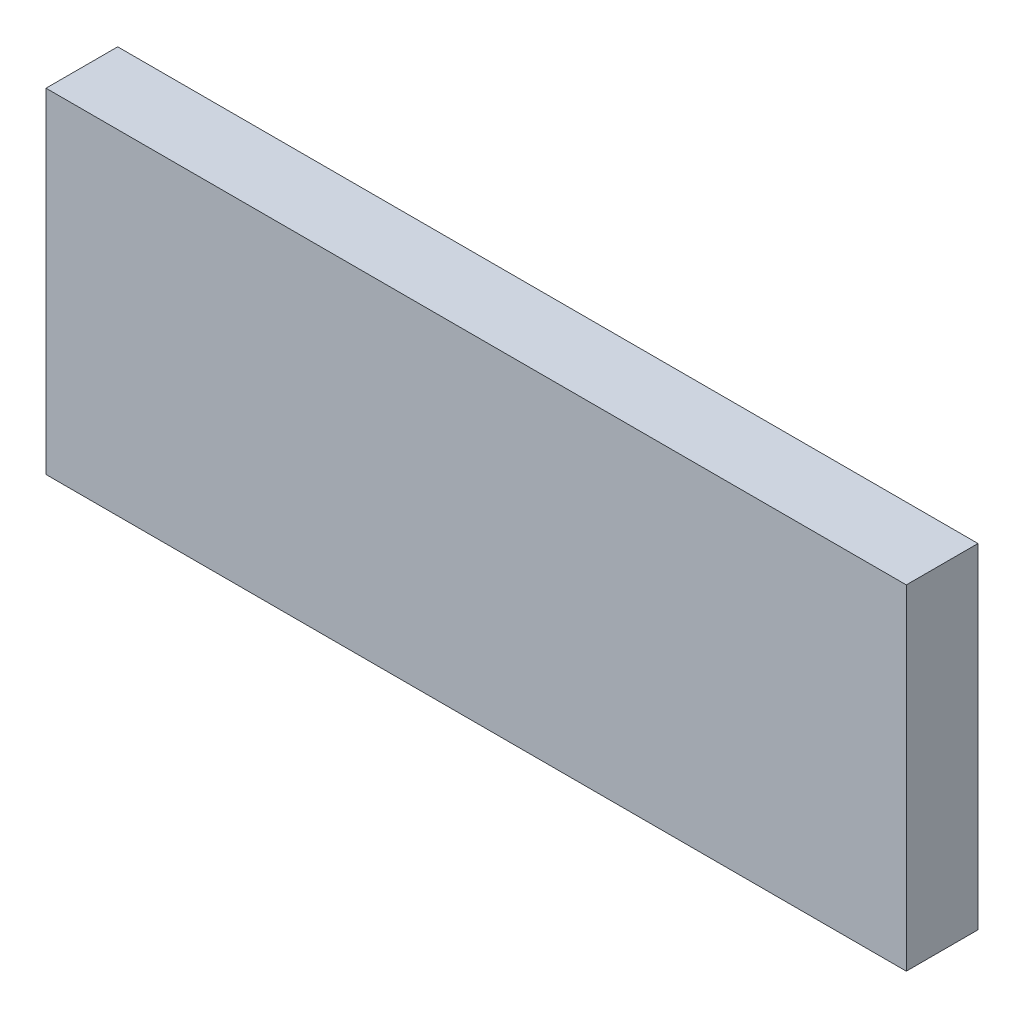
ISO-10303-21;
HEADER;
FILE_DESCRIPTION(('STEP AP214'),'2;1');
FILE_NAME('part.step','',(''),(''),'','','');
FILE_SCHEMA(('AUTOMOTIVE_DESIGN { 1 0 10303 214 1 1 1 1 }'));
ENDSEC;
DATA;
#1=APPLICATION_CONTEXT('core data for automotive mechanical design processes');
#2=APPLICATION_PROTOCOL_DEFINITION('international standard','automotive_design',2000,#1);
#3=PRODUCT_CONTEXT('',#1,'mechanical');
#4=PRODUCT('Part','Part','',(#3));
#5=PRODUCT_RELATED_PRODUCT_CATEGORY('part','',(#4));
#6=PRODUCT_DEFINITION_FORMATION('','',#4);
#7=PRODUCT_DEFINITION_CONTEXT('part definition',#1,'design');
#8=PRODUCT_DEFINITION('design','',#6,#7);
#9=PRODUCT_DEFINITION_SHAPE('','',#8);
#10=(LENGTH_UNIT() NAMED_UNIT(*) SI_UNIT(.MILLI.,.METRE.));
#11=(NAMED_UNIT(*) PLANE_ANGLE_UNIT() SI_UNIT($,.RADIAN.));
#12=(NAMED_UNIT(*) SI_UNIT($,.STERADIAN.) SOLID_ANGLE_UNIT());
#13=UNCERTAINTY_MEASURE_WITH_UNIT(LENGTH_MEASURE(1.E-05),#10,'distance_accuracy_value','');
#14=(GEOMETRIC_REPRESENTATION_CONTEXT(3) GLOBAL_UNCERTAINTY_ASSIGNED_CONTEXT((#13)) GLOBAL_UNIT_ASSIGNED_CONTEXT((#10,
#11,#12)) REPRESENTATION_CONTEXT('',''));
#15=CARTESIAN_POINT('',(0.,0.,0.));
#16=DIRECTION('',(0.,0.,1.));
#17=DIRECTION('',(1.,0.,0.));
#18=AXIS2_PLACEMENT_3D('',#15,#16,#17);
#19=CARTESIAN_POINT('',(0.,0.,0.));
#20=DIRECTION('',(0.,0.,-1.));
#21=DIRECTION('',(-1.,0.,0.));
#22=AXIS2_PLACEMENT_3D('',#19,#20,#21);
#23=PLANE('',#22);
#24=DIRECTION('',(0.,1.,0.));
#25=VECTOR('',#24,1.);
#26=CARTESIAN_POINT('',(-1.95,-1.15,0.));
#27=LINE('',#26,#25);
#28=CARTESIAN_POINT('',(-1.95,-1.85,0.));
#29=VERTEX_POINT('',#28);
#30=CARTESIAN_POINT('',(-1.95,-1.15,0.));
#31=VERTEX_POINT('',#30);
#32=EDGE_CURVE('E57',#29,#31,#27,.T.);
#33=ORIENTED_EDGE('',*,*,#32,.F.);
#34=DIRECTION('',(1.,0.,0.));
#35=VECTOR('',#34,1.);
#36=CARTESIAN_POINT('',(-1.95,-1.85,0.));
#37=LINE('',#36,#35);
#38=CARTESIAN_POINT('',(-3.75,-1.85,0.));
#39=VERTEX_POINT('',#38);
#40=EDGE_CURVE('E52',#39,#29,#37,.T.);
#41=ORIENTED_EDGE('',*,*,#40,.F.);
#42=DIRECTION('',(0.,1.,0.));
#43=VECTOR('',#42,1.);
#44=CARTESIAN_POINT('',(-3.75,0.,0.));
#45=LINE('',#44,#43);
#46=CARTESIAN_POINT('',(-3.75,-1.15,0.));
#47=VERTEX_POINT('',#46);
#48=EDGE_CURVE('E19',#39,#47,#45,.T.);
#49=ORIENTED_EDGE('',*,*,#48,.T.);
#50=DIRECTION('',(-1.,0.,0.));
#51=VECTOR('',#50,1.);
#52=CARTESIAN_POINT('',(-3.75,-1.15,0.));
#53=LINE('',#52,#51);
#54=EDGE_CURVE('E66',#31,#47,#53,.T.);
#55=ORIENTED_EDGE('',*,*,#54,.F.);
#56=EDGE_LOOP('',(#33,#41,#49,#55));
#57=FACE_BOUND('',#56,.T.);
#58=ADVANCED_FACE('F16',(#57),#23,.T.);
#59=CARTESIAN_POINT('',(-3.75,-1.15,0.15));
#60=DIRECTION('',(0.,1.,0.));
#61=DIRECTION('',(-1.,0.,0.));
#62=AXIS2_PLACEMENT_3D('',#59,#60,#61);
#63=PLANE('',#62);
#64=DIRECTION('',(-1.,0.,0.));
#65=VECTOR('',#64,1.);
#66=CARTESIAN_POINT('',(0.,-1.15,0.15));
#67=LINE('',#66,#65);
#68=CARTESIAN_POINT('',(-3.75,-1.15,0.15));
#69=VERTEX_POINT('',#68);
#70=CARTESIAN_POINT('',(-1.95,-1.15,0.15));
#71=VERTEX_POINT('',#70);
#72=EDGE_CURVE('E74',#69,#71,#67,.F.);
#73=ORIENTED_EDGE('',*,*,#72,.T.);
#74=DIRECTION('',(0.,0.,-1.));
#75=VECTOR('',#74,1.);
#76=CARTESIAN_POINT('',(-1.95,-1.15,0.15));
#77=LINE('',#76,#75);
#78=EDGE_CURVE('E62',#31,#71,#77,.F.);
#79=ORIENTED_EDGE('',*,*,#78,.F.);
#80=ORIENTED_EDGE('',*,*,#54,.T.);
#81=DIRECTION('',(0.,0.,1.));
#82=VECTOR('',#81,1.);
#83=CARTESIAN_POINT('',(-3.75,-1.15,0.15));
#84=LINE('',#83,#82);
#85=EDGE_CURVE('E80',#69,#47,#84,.F.);
#86=ORIENTED_EDGE('',*,*,#85,.F.);
#87=EDGE_LOOP('',(#73,#79,#80,#86));
#88=FACE_BOUND('',#87,.T.);
#89=ADVANCED_FACE('F73',(#88),#63,.T.);
#90=CARTESIAN_POINT('',(-1.95,-1.15,0.15));
#91=DIRECTION('',(1.,0.,0.));
#92=DIRECTION('',(0.,0.,-1.));
#93=AXIS2_PLACEMENT_3D('',#90,#91,#92);
#94=PLANE('',#93);
#95=DIRECTION('',(0.,1.,0.));
#96=VECTOR('',#95,1.);
#97=CARTESIAN_POINT('',(-1.95,0.,0.15));
#98=LINE('',#97,#96);
#99=CARTESIAN_POINT('',(-1.95,-1.85,0.15));
#100=VERTEX_POINT('',#99);
#101=EDGE_CURVE('E83',#71,#100,#98,.F.);
#102=ORIENTED_EDGE('',*,*,#101,.T.);
#103=DIRECTION('',(0.,0.,-1.));
#104=VECTOR('',#103,1.);
#105=CARTESIAN_POINT('',(-1.95,-1.85,0.15));
#106=LINE('',#105,#104);
#107=EDGE_CURVE('E64',#29,#100,#106,.F.);
#108=ORIENTED_EDGE('',*,*,#107,.F.);
#109=ORIENTED_EDGE('',*,*,#32,.T.);
#110=ORIENTED_EDGE('',*,*,#78,.T.);
#111=EDGE_LOOP('',(#102,#108,#109,#110));
#112=FACE_BOUND('',#111,.T.);
#113=ADVANCED_FACE('F60',(#112),#94,.T.);
#114=CARTESIAN_POINT('',(-1.95,-1.85,0.15));
#115=DIRECTION('',(0.,-1.,0.));
#116=DIRECTION('',(0.,0.,-1.));
#117=AXIS2_PLACEMENT_3D('',#114,#115,#116);
#118=PLANE('',#117);
#119=DIRECTION('',(-1.,0.,0.));
#120=VECTOR('',#119,1.);
#121=CARTESIAN_POINT('',(0.,-1.85,0.15));
#122=LINE('',#121,#120);
#123=CARTESIAN_POINT('',(-3.75,-1.85,0.15));
#124=VERTEX_POINT('',#123);
#125=EDGE_CURVE('E25',#100,#124,#122,.T.);
#126=ORIENTED_EDGE('',*,*,#125,.T.);
#127=DIRECTION('',(0.,0.,1.));
#128=VECTOR('',#127,1.);
#129=CARTESIAN_POINT('',(-3.75,-1.85,0.15));
#130=LINE('',#129,#128);
#131=EDGE_CURVE('E33',#39,#124,#130,.T.);
#132=ORIENTED_EDGE('',*,*,#131,.F.);
#133=ORIENTED_EDGE('',*,*,#40,.T.);
#134=ORIENTED_EDGE('',*,*,#107,.T.);
#135=EDGE_LOOP('',(#126,#132,#133,#134));
#136=FACE_BOUND('',#135,.T.);
#137=ADVANCED_FACE('F87',(#136),#118,.T.);
#138=CARTESIAN_POINT('',(-3.75,-1.85,0.15));
#139=DIRECTION('',(-1.,0.,0.));
#140=DIRECTION('',(0.,-1.,0.));
#141=AXIS2_PLACEMENT_3D('',#138,#139,#140);
#142=PLANE('',#141);
#143=DIRECTION('',(0.,1.,0.));
#144=VECTOR('',#143,1.);
#145=CARTESIAN_POINT('',(-3.75,0.,0.15));
#146=LINE('',#145,#144);
#147=EDGE_CURVE('E11',#124,#69,#146,.T.);
#148=ORIENTED_EDGE('',*,*,#147,.T.);
#149=ORIENTED_EDGE('',*,*,#85,.T.);
#150=ORIENTED_EDGE('',*,*,#48,.F.);
#151=ORIENTED_EDGE('',*,*,#131,.T.);
#152=EDGE_LOOP('',(#148,#149,#150,#151));
#153=FACE_BOUND('',#152,.T.);
#154=ADVANCED_FACE('F90',(#153),#142,.T.);
#155=CARTESIAN_POINT('',(0.,0.,0.15));
#156=DIRECTION('',(0.,0.,-1.));
#157=DIRECTION('',(-1.,0.,0.));
#158=AXIS2_PLACEMENT_3D('',#155,#156,#157);
#159=PLANE('',#158);
#160=ORIENTED_EDGE('',*,*,#125,.F.);
#161=ORIENTED_EDGE('',*,*,#101,.F.);
#162=ORIENTED_EDGE('',*,*,#72,.F.);
#163=ORIENTED_EDGE('',*,*,#147,.F.);
#164=EDGE_LOOP('',(#160,#161,#162,#163));
#165=FACE_BOUND('',#164,.T.);
#166=ADVANCED_FACE('F89',(#165),#159,.F.);
#167=CLOSED_SHELL('',(#58,#89,#113,#137,#154,#166));
#168=MANIFOLD_SOLID_BREP('B1',#167);
#169=ADVANCED_BREP_SHAPE_REPRESENTATION('',(#18,#168),#14);
#170=SHAPE_DEFINITION_REPRESENTATION(#9,#169);
ENDSEC;
END-ISO-10303-21;
